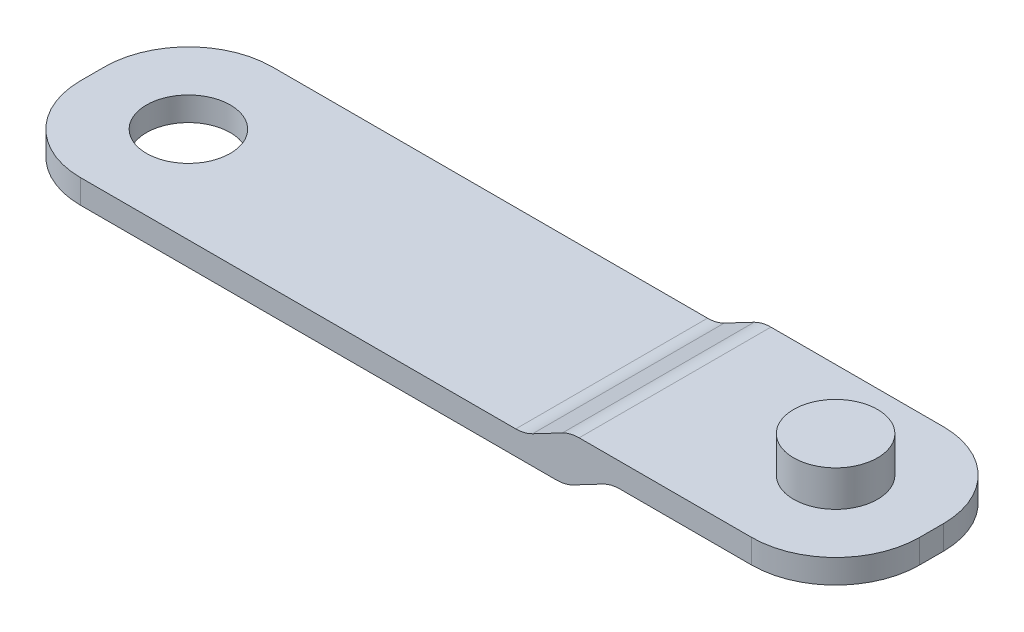
ISO-10303-21;
HEADER;
FILE_DESCRIPTION(('STEP AP214'),'2;1');
FILE_NAME('part.step','',(''),(''),'','','');
FILE_SCHEMA(('AUTOMOTIVE_DESIGN { 1 0 10303 214 1 1 1 1 }'));
ENDSEC;
DATA;
#1=APPLICATION_CONTEXT('core data for automotive mechanical design processes');
#2=APPLICATION_PROTOCOL_DEFINITION('international standard','automotive_design',2000,#1);
#3=PRODUCT_CONTEXT('',#1,'mechanical');
#4=PRODUCT('Part','Part','',(#3));
#5=PRODUCT_RELATED_PRODUCT_CATEGORY('part','',(#4));
#6=PRODUCT_DEFINITION_FORMATION('','',#4);
#7=PRODUCT_DEFINITION_CONTEXT('part definition',#1,'design');
#8=PRODUCT_DEFINITION('design','',#6,#7);
#9=PRODUCT_DEFINITION_SHAPE('','',#8);
#10=(LENGTH_UNIT() NAMED_UNIT(*) SI_UNIT(.MILLI.,.METRE.));
#11=(NAMED_UNIT(*) PLANE_ANGLE_UNIT() SI_UNIT($,.RADIAN.));
#12=(NAMED_UNIT(*) SI_UNIT($,.STERADIAN.) SOLID_ANGLE_UNIT());
#13=UNCERTAINTY_MEASURE_WITH_UNIT(LENGTH_MEASURE(1.E-05),#10,'distance_accuracy_value','');
#14=(GEOMETRIC_REPRESENTATION_CONTEXT(3) GLOBAL_UNCERTAINTY_ASSIGNED_CONTEXT((#13)) GLOBAL_UNIT_ASSIGNED_CONTEXT((#10,
#11,#12)) REPRESENTATION_CONTEXT('',''));
#15=CARTESIAN_POINT('',(0.,0.,0.));
#16=DIRECTION('',(0.,0.,1.));
#17=DIRECTION('',(1.,0.,0.));
#18=AXIS2_PLACEMENT_3D('',#15,#16,#17);
#19=CARTESIAN_POINT('',(35.4089529862073,4.,0.000403363956020933));
#20=DIRECTION('',(-0.999999999935116,0.,-1.13915809979437E-05));
#21=DIRECTION('',(-1.13915809979437E-05,0.,0.999999999935116));
#22=AXIS2_PLACEMENT_3D('',#19,#20,#21);
#23=PLANE('',#22);
#24=DIRECTION('',(0.,-1.,0.));
#25=VECTOR('',#24,1.);
#26=CARTESIAN_POINT('',(35.4089408148206,4.,1.06885792671711));
#27=LINE('',#26,#25);
#28=CARTESIAN_POINT('',(35.4089408148206,4.,1.06885792671711));
#29=VERTEX_POINT('',#28);
#30=CARTESIAN_POINT('',(35.4089408148207,2.,1.0688579267171));
#31=VERTEX_POINT('',#30);
#32=EDGE_CURVE('E207',#29,#31,#27,.T.);
#33=ORIENTED_EDGE('',*,*,#32,.T.);
#34=DIRECTION('',(-1.13915810110164E-05,0.,0.999999999935116));
#35=VECTOR('',#34,1.);
#36=CARTESIAN_POINT('',(35.4090433472251,2.,-7.93185974184842));
#37=LINE('',#36,#35);
#38=CARTESIAN_POINT('',(35.4089635979827,2.,-0.931142073153133));
#39=VERTEX_POINT('',#38);
#40=EDGE_CURVE('E184',#39,#31,#37,.T.);
#41=ORIENTED_EDGE('',*,*,#40,.F.);
#42=DIRECTION('',(0.,-1.,0.));
#43=VECTOR('',#42,1.);
#44=CARTESIAN_POINT('',(35.4089635979826,4.,-0.931142073153123));
#45=LINE('',#44,#43);
#46=CARTESIAN_POINT('',(35.4089635979826,4.,-0.931142073153123));
#47=VERTEX_POINT('',#46);
#48=EDGE_CURVE('E191',#47,#39,#45,.T.);
#49=ORIENTED_EDGE('',*,*,#48,.F.);
#50=DIRECTION('',(1.13915809979437E-05,0.,-0.999999999935116));
#51=VECTOR('',#50,1.);
#52=CARTESIAN_POINT('',(35.4089529862073,4.,0.000403363956020933));
#53=LINE('',#52,#51);
#54=EDGE_CURVE('E336',#29,#47,#53,.T.);
#55=ORIENTED_EDGE('',*,*,#54,.F.);
#56=EDGE_LOOP('',(#33,#41,#49,#55));
#57=FACE_BOUND('',#56,.T.);
#58=ADVANCED_FACE('F63',(#57),#23,.F.);
#59=CARTESIAN_POINT('',(28.4089635984368,4.,-0.931221814220212));
#60=DIRECTION('',(0.,-1.,0.));
#61=DIRECTION('',(0.,0.,-1.));
#62=AXIS2_PLACEMENT_3D('',#59,#60,#61);
#63=CYLINDRICAL_SURFACE('',#62,7.);
#64=ORIENTED_EDGE('',*,*,#48,.T.);
#65=CARTESIAN_POINT('',(28.4089635984368,2.,-0.931221814220212));
#66=DIRECTION('',(0.,1.,0.));
#67=DIRECTION('',(0.,0.,1.));
#68=AXIS2_PLACEMENT_3D('',#65,#66,#67);
#69=CIRCLE('',#68,7.);
#70=CARTESIAN_POINT('',(28.409043339504,2.,-7.93122181376603));
#71=VERTEX_POINT('',#70);
#72=EDGE_CURVE('E237',#39,#71,#69,.T.);
#73=ORIENTED_EDGE('',*,*,#72,.T.);
#74=DIRECTION('',(0.,-1.,0.));
#75=VECTOR('',#74,1.);
#76=CARTESIAN_POINT('',(28.409043339504,4.,-7.93122181376603));
#77=LINE('',#76,#75);
#78=CARTESIAN_POINT('',(28.409043339504,4.,-7.93122181376603));
#79=VERTEX_POINT('',#78);
#80=EDGE_CURVE('E225',#79,#71,#77,.T.);
#81=ORIENTED_EDGE('',*,*,#80,.F.);
#82=CARTESIAN_POINT('',(28.4089635984368,4.,-0.931221814220212));
#83=DIRECTION('',(0.,1.,0.));
#84=DIRECTION('',(0.,0.,1.));
#85=AXIS2_PLACEMENT_3D('',#82,#83,#84);
#86=CIRCLE('',#85,7.);
#87=EDGE_CURVE('E340',#47,#79,#86,.T.);
#88=ORIENTED_EDGE('',*,*,#87,.F.);
#89=EDGE_LOOP('',(#64,#73,#81,#88));
#90=FACE_BOUND('',#89,.T.);
#91=ADVANCED_FACE('F391',(#90),#63,.T.);
#92=CARTESIAN_POINT('',(9.03528424001264E-05,4.,-7.93154543665548));
#93=DIRECTION('',(-1.13915810122829E-05,0.,0.999999999935116));
#94=DIRECTION('',(0.999999999935116,0.,1.13915810122829E-05));
#95=AXIS2_PLACEMENT_3D('',#92,#93,#94);
#96=PLANE('',#95);
#97=DIRECTION('',(0.885249595787876,0.465116279069769,1.00843924871626E-05));
#98=VECTOR('',#97,1.);
#99=CARTESIAN_POINT('',(2.87114327741969,-1.46443664878954,-7.93151273082349));
#100=LINE('',#99,#98);
#101=CARTESIAN_POINT('',(10.1201679651821,2.34425121246406,-7.9314301529715));
#102=VERTEX_POINT('',#101);
#103=CARTESIAN_POINT('',(12.6163237663318,3.65574878753595,-7.93140171781047));
#104=VERTEX_POINT('',#103);
#105=EDGE_CURVE('E286',#102,#104,#100,.T.);
#106=ORIENTED_EDGE('',*,*,#105,.T.);
#107=CARTESIAN_POINT('',(14.0116726034506,1.,-7.93138582258115));
#108=DIRECTION('',(-1.13915810122829E-05,0.,0.999999999935116));
#109=DIRECTION('',(0.999999999935116,0.,1.13915810122829E-05));
#110=AXIS2_PLACEMENT_3D('',#107,#108,#109);
#111=CIRCLE('',#110,3.);
#112=CARTESIAN_POINT('',(14.0116726034506,4.,-7.93138582258115));
#113=VERTEX_POINT('',#112);
#114=EDGE_CURVE('E248',#104,#113,#111,.F.);
#115=ORIENTED_EDGE('',*,*,#114,.T.);
#116=DIRECTION('',(-0.999999999935116,0.,-1.13915810122829E-05));
#117=VECTOR('',#116,1.);
#118=CARTESIAN_POINT('',(9.03528424001264E-05,4.,-7.93154543665548));
#119=LINE('',#118,#117);
#120=EDGE_CURVE('E344',#79,#113,#119,.T.);
#121=ORIENTED_EDGE('',*,*,#120,.F.);
#122=ORIENTED_EDGE('',*,*,#80,.T.);
#123=DIRECTION('',(-0.999999999935116,0.,-1.13915810122829E-05));
#124=VECTOR('',#123,1.);
#125=CARTESIAN_POINT('',(9.03528424001264E-05,2.,-7.93154543665548));
#126=LINE('',#125,#124);
#127=CARTESIAN_POINT('',(17.4052778946254,2.,-7.93134716405155));
#128=VERTEX_POINT('',#127);
#129=EDGE_CURVE('E297',#71,#128,#126,.T.);
#130=ORIENTED_EDGE('',*,*,#129,.T.);
#131=CARTESIAN_POINT('',(17.4052778946254,-1.,-7.93134716405155));
#132=DIRECTION('',(-1.13915810122829E-05,0.,0.999999999935116));
#133=DIRECTION('',(0.999999999935116,0.,1.13915810122829E-05));
#134=AXIS2_PLACEMENT_3D('',#131,#132,#133);
#135=CIRCLE('',#134,3.);
#136=CARTESIAN_POINT('',(16.0099290575066,1.65574878753595,-7.93136305928086));
#137=VERTEX_POINT('',#136);
#138=EDGE_CURVE('E12',#128,#137,#135,.T.);
#139=ORIENTED_EDGE('',*,*,#138,.T.);
#140=DIRECTION('',(-0.885249595787877,-0.465116279069768,-1.00843924871626E-05));
#141=VECTOR('',#140,1.);
#142=CARTESIAN_POINT('',(4.42878060636781,-4.42906695322044,-7.93149498687167));
#143=LINE('',#142,#141);
#144=CARTESIAN_POINT('',(13.5137732563569,0.344251212464054,-7.9313914944419));
#145=VERTEX_POINT('',#144);
#146=EDGE_CURVE('E298',#137,#145,#143,.T.);
#147=ORIENTED_EDGE('',*,*,#146,.T.);
#148=CARTESIAN_POINT('',(12.1184244192382,3.,-7.93140738967122));
#149=DIRECTION('',(-1.13915810122829E-05,0.,0.999999999935116));
#150=DIRECTION('',(0.999999999935116,0.,1.13915810122829E-05));
#151=AXIS2_PLACEMENT_3D('',#148,#149,#150);
#152=CIRCLE('',#151,3.);
#153=CARTESIAN_POINT('',(12.1184244192382,0.,-7.93140738967122));
#154=VERTEX_POINT('',#153);
#155=EDGE_CURVE('E245',#145,#154,#152,.F.);
#156=ORIENTED_EDGE('',*,*,#155,.T.);
#157=DIRECTION('',(-0.999999999935116,0.,-1.13915810122829E-05));
#158=VECTOR('',#157,1.);
#159=CARTESIAN_POINT('',(9.03528424001264E-05,0.,-7.93154543665548));
#160=LINE('',#159,#158);
#161=CARTESIAN_POINT('',(-27.5909566568626,0.,-7.93185974230271));
#162=VERTEX_POINT('',#161);
#163=EDGE_CURVE('E356',#154,#162,#160,.T.);
#164=ORIENTED_EDGE('',*,*,#163,.T.);
#165=DIRECTION('',(0.,-1.,0.));
#166=VECTOR('',#165,1.);
#167=CARTESIAN_POINT('',(-27.5909566568626,4.,-7.93185974230271));
#168=LINE('',#167,#166);
#169=CARTESIAN_POINT('',(-27.5909566568626,2.,-7.9318597423027));
#170=VERTEX_POINT('',#169);
#171=EDGE_CURVE('E221',#170,#162,#168,.T.);
#172=ORIENTED_EDGE('',*,*,#171,.F.);
#173=DIRECTION('',(0.999999999935116,0.,1.13915810122829E-05));
#174=VECTOR('',#173,1.);
#175=CARTESIAN_POINT('',(9.03528424001264E-05,2.,-7.93154543665548));
#176=LINE('',#175,#174);
#177=CARTESIAN_POINT('',(8.72481912806332,2.,-7.93144604820082));
#178=VERTEX_POINT('',#177);
#179=EDGE_CURVE('E288',#170,#178,#176,.T.);
#180=ORIENTED_EDGE('',*,*,#179,.T.);
#181=CARTESIAN_POINT('',(8.72481912806332,5.,-7.93144604820082));
#182=DIRECTION('',(-1.13915810122829E-05,0.,0.999999999935116));
#183=DIRECTION('',(0.999999999935116,0.,1.13915810122829E-05));
#184=AXIS2_PLACEMENT_3D('',#181,#182,#183);
#185=CIRCLE('',#184,3.);
#186=EDGE_CURVE('E277',#178,#102,#185,.T.);
#187=ORIENTED_EDGE('',*,*,#186,.T.);
#188=EDGE_LOOP('',(#106,#115,#121,#122,#130,#139,#147,#156,#164,#172,#180,#187));
#189=FACE_BOUND('',#188,.T.);
#190=ADVANCED_FACE('F285',(#189),#96,.F.);
#191=CARTESIAN_POINT('',(-27.5910363979297,4.,-0.931859742756886));
#192=DIRECTION('',(0.,-1.,0.));
#193=DIRECTION('',(0.,0.,-1.));
#194=AXIS2_PLACEMENT_3D('',#191,#192,#193);
#195=CYLINDRICAL_SURFACE('',#194,7.);
#196=DIRECTION('',(0.,-1.,0.));
#197=VECTOR('',#196,1.);
#198=CARTESIAN_POINT('',(-34.5910363974755,4.,-0.931939483823968));
#199=LINE('',#198,#197);
#200=CARTESIAN_POINT('',(-34.5910363974755,2.,-0.931939483823968));
#201=VERTEX_POINT('',#200);
#202=CARTESIAN_POINT('',(-34.5910363974755,0.,-0.931939483823968));
#203=VERTEX_POINT('',#202);
#204=EDGE_CURVE('E218',#201,#203,#199,.T.);
#205=ORIENTED_EDGE('',*,*,#204,.F.);
#206=CARTESIAN_POINT('',(-27.5910363979297,2.,-0.931859742756886));
#207=DIRECTION('',(0.,-1.,0.));
#208=DIRECTION('',(0.,0.,-1.));
#209=AXIS2_PLACEMENT_3D('',#206,#207,#208);
#210=CIRCLE('',#209,7.);
#211=EDGE_CURVE('E330',#201,#170,#210,.T.);
#212=ORIENTED_EDGE('',*,*,#211,.T.);
#213=ORIENTED_EDGE('',*,*,#171,.T.);
#214=CARTESIAN_POINT('',(-27.5910363979297,0.,-0.931859742756886));
#215=DIRECTION('',(0.,1.,0.));
#216=DIRECTION('',(0.,0.,1.));
#217=AXIS2_PLACEMENT_3D('',#214,#215,#216);
#218=CIRCLE('',#217,7.);
#219=EDGE_CURVE('E359',#162,#203,#218,.T.);
#220=ORIENTED_EDGE('',*,*,#219,.T.);
#221=EDGE_LOOP('',(#205,#212,#213,#220));
#222=FACE_BOUND('',#221,.T.);
#223=ADVANCED_FACE('F448',(#222),#195,.T.);
#224=CARTESIAN_POINT('',(-34.5910470092508,4.,-0.000394046714075155));
#225=DIRECTION('',(0.999999999935116,0.,1.13915810048827E-05));
#226=DIRECTION('',(1.13915810048827E-05,0.,-0.999999999935116));
#227=AXIS2_PLACEMENT_3D('',#224,#225,#226);
#228=PLANE('',#227);
#229=DIRECTION('',(0.,-1.,0.));
#230=VECTOR('',#229,1.);
#231=CARTESIAN_POINT('',(-34.5910591806375,4.,1.06806051604623));
#232=LINE('',#231,#230);
#233=CARTESIAN_POINT('',(-34.5910591806375,2.,1.06806051604627));
#234=VERTEX_POINT('',#233);
#235=CARTESIAN_POINT('',(-34.5910591806375,0.,1.06806051604623));
#236=VERTEX_POINT('',#235);
#237=EDGE_CURVE('E211',#234,#236,#232,.T.);
#238=ORIENTED_EDGE('',*,*,#237,.F.);
#239=DIRECTION('',(-1.13915810110164E-05,0.,0.999999999935116));
#240=VECTOR('',#239,1.);
#241=CARTESIAN_POINT('',(-34.590956648233,2.,-7.9326571525192));
#242=LINE('',#241,#240);
#243=EDGE_CURVE('E312',#201,#234,#242,.T.);
#244=ORIENTED_EDGE('',*,*,#243,.F.);
#245=ORIENTED_EDGE('',*,*,#204,.T.);
#246=DIRECTION('',(-1.13915810048827E-05,0.,0.999999999935116));
#247=VECTOR('',#246,1.);
#248=CARTESIAN_POINT('',(-34.5910470092508,0.,-0.000394046714075155));
#249=LINE('',#248,#247);
#250=EDGE_CURVE('E363',#203,#236,#249,.T.);
#251=ORIENTED_EDGE('',*,*,#250,.T.);
#252=EDGE_LOOP('',(#238,#244,#245,#251));
#253=FACE_BOUND('',#252,.T.);
#254=ADVANCED_FACE('F444',(#253),#228,.F.);
#255=CARTESIAN_POINT('',(-27.5910591810917,4.,1.06814025711334));
#256=DIRECTION('',(0.,-1.,0.));
#257=DIRECTION('',(0.,0.,-1.));
#258=AXIS2_PLACEMENT_3D('',#255,#256,#257);
#259=CYLINDRICAL_SURFACE('',#258,7.00000000000001);
#260=DIRECTION('',(0.,-1.,0.));
#261=VECTOR('',#260,1.);
#262=CARTESIAN_POINT('',(-27.5911389221588,4.,8.06814025665917));
#263=LINE('',#262,#261);
#264=CARTESIAN_POINT('',(-27.5911389221588,2.,8.06814025665916));
#265=VERTEX_POINT('',#264);
#266=CARTESIAN_POINT('',(-27.5911389221588,0.,8.06814025665917));
#267=VERTEX_POINT('',#266);
#268=EDGE_CURVE('E206',#265,#267,#263,.T.);
#269=ORIENTED_EDGE('',*,*,#268,.F.);
#270=CARTESIAN_POINT('',(-27.5910591810917,2.,1.06814025711334));
#271=DIRECTION('',(0.,-1.,0.));
#272=DIRECTION('',(0.,0.,-1.));
#273=AXIS2_PLACEMENT_3D('',#270,#271,#272);
#274=CIRCLE('',#273,7.00000000000001);
#275=EDGE_CURVE('E236',#265,#234,#274,.T.);
#276=ORIENTED_EDGE('',*,*,#275,.T.);
#277=ORIENTED_EDGE('',*,*,#237,.T.);
#278=CARTESIAN_POINT('',(-27.5910591810917,0.,1.06814025711334));
#279=DIRECTION('',(0.,1.,0.));
#280=DIRECTION('',(0.,0.,1.));
#281=AXIS2_PLACEMENT_3D('',#278,#279,#280);
#282=CIRCLE('',#281,7.00000000000001);
#283=EDGE_CURVE('E367',#236,#267,#282,.T.);
#284=ORIENTED_EDGE('',*,*,#283,.T.);
#285=EDGE_LOOP('',(#269,#276,#277,#284));
#286=FACE_BOUND('',#285,.T.);
#287=ADVANCED_FACE('F425',(#286),#259,.T.);
#288=CARTESIAN_POINT('',(-9.19124537861815E-05,4.,8.06845456230638));
#289=DIRECTION('',(1.13915810110164E-05,0.,-0.999999999935116));
#290=DIRECTION('',(-0.999999999935116,0.,-1.13915810110164E-05));
#291=AXIS2_PLACEMENT_3D('',#288,#289,#290);
#292=PLANE('',#291);
#293=DIRECTION('',(0.999999999935116,0.,1.13915810110164E-05));
#294=VECTOR('',#293,1.);
#295=CARTESIAN_POINT('',(-9.19124537861815E-05,4.,8.06845456230638));
#296=LINE('',#295,#294);
#297=CARTESIAN_POINT('',(14.0114903381544,4.,8.06861417638069));
#298=VERTEX_POINT('',#297);
#299=CARTESIAN_POINT('',(28.4088610742077,4.,8.06877818519584));
#300=VERTEX_POINT('',#299);
#301=EDGE_CURVE('E348',#298,#300,#296,.T.);
#302=ORIENTED_EDGE('',*,*,#301,.F.);
#303=CARTESIAN_POINT('',(14.0114903381544,1.,8.06861417638069));
#304=DIRECTION('',(1.13915810110164E-05,0.,-0.999999999935116));
#305=DIRECTION('',(-0.999999999935116,0.,-1.13915810110164E-05));
#306=AXIS2_PLACEMENT_3D('',#303,#304,#305);
#307=CIRCLE('',#306,3.);
#308=CARTESIAN_POINT('',(12.6161415010356,3.65574878753594,8.06859828115137));
#309=VERTEX_POINT('',#308);
#310=EDGE_CURVE('E256',#298,#309,#307,.F.);
#311=ORIENTED_EDGE('',*,*,#310,.T.);
#312=DIRECTION('',(0.885249595787876,0.465116279069768,1.00843924860584E-05));
#313=VECTOR('',#312,1.);
#314=CARTESIAN_POINT('',(1.22398501996001,-2.32976926101237,8.06846850647791));
#315=LINE('',#314,#313);
#316=CARTESIAN_POINT('',(10.1199856998859,2.34425121246405,8.06856984599034));
#317=VERTEX_POINT('',#316);
#318=EDGE_CURVE('E308',#317,#309,#315,.T.);
#319=ORIENTED_EDGE('',*,*,#318,.F.);
#320=CARTESIAN_POINT('',(8.72463686276714,5.,8.06855395076103));
#321=DIRECTION('',(1.13915810110164E-05,0.,-0.999999999935116));
#322=DIRECTION('',(-0.999999999935116,0.,-1.13915810110164E-05));
#323=AXIS2_PLACEMENT_3D('',#320,#321,#322);
#324=CIRCLE('',#323,3.);
#325=CARTESIAN_POINT('',(8.72463686276715,2.,8.06855395076102));
#326=VERTEX_POINT('',#325);
#327=EDGE_CURVE('E87',#317,#326,#324,.T.);
#328=ORIENTED_EDGE('',*,*,#327,.T.);
#329=DIRECTION('',(0.999999999935116,0.,1.13915810110297E-05));
#330=VECTOR('',#329,1.);
#331=CARTESIAN_POINT('',(-9.1912453786289E-05,2.,8.06845456230637));
#332=LINE('',#331,#330);
#333=EDGE_CURVE('E304',#265,#326,#332,.T.);
#334=ORIENTED_EDGE('',*,*,#333,.F.);
#335=ORIENTED_EDGE('',*,*,#268,.T.);
#336=DIRECTION('',(0.999999999935116,0.,1.13915810110164E-05));
#337=VECTOR('',#336,1.);
#338=CARTESIAN_POINT('',(-9.19124537861815E-05,0.,8.06845456230638));
#339=LINE('',#338,#337);
#340=CARTESIAN_POINT('',(12.118242153942,0.,8.06859260929062));
#341=VERTEX_POINT('',#340);
#342=EDGE_CURVE('E341',#267,#341,#339,.T.);
#343=ORIENTED_EDGE('',*,*,#342,.T.);
#344=CARTESIAN_POINT('',(12.118242153942,3.,8.06859260929062));
#345=DIRECTION('',(1.13915810110164E-05,0.,-0.999999999935116));
#346=DIRECTION('',(-0.999999999935116,0.,-1.13915810110164E-05));
#347=AXIS2_PLACEMENT_3D('',#344,#345,#346);
#348=CIRCLE('',#347,3.);
#349=CARTESIAN_POINT('',(13.5135909910607,0.344251212464052,8.06860850451994));
#350=VERTEX_POINT('',#349);
#351=EDGE_CURVE('E79',#341,#350,#348,.F.);
#352=ORIENTED_EDGE('',*,*,#351,.T.);
#353=DIRECTION('',(-0.885249595787877,-0.465116279069768,-1.00843924860584E-05));
#354=VECTOR('',#353,1.);
#355=CARTESIAN_POINT('',(2.78162234890813,-5.29439956544326,8.06848625042973));
#356=LINE('',#355,#354);
#357=CARTESIAN_POINT('',(16.0097467922105,1.65574878753594,8.06863693968096));
#358=VERTEX_POINT('',#357);
#359=EDGE_CURVE('E200',#358,#350,#356,.T.);
#360=ORIENTED_EDGE('',*,*,#359,.F.);
#361=CARTESIAN_POINT('',(17.4050956293292,-1.,8.06865283491028));
#362=DIRECTION('',(1.13915810110164E-05,0.,-0.999999999935116));
#363=DIRECTION('',(-0.999999999935116,0.,-1.13915810110164E-05));
#364=AXIS2_PLACEMENT_3D('',#361,#362,#363);
#365=CIRCLE('',#364,3.);
#366=CARTESIAN_POINT('',(17.4050956293292,2.,8.06865283491028));
#367=VERTEX_POINT('',#366);
#368=EDGE_CURVE('E72',#358,#367,#365,.T.);
#369=ORIENTED_EDGE('',*,*,#368,.T.);
#370=DIRECTION('',(-0.999999999935116,0.,-1.13915810110297E-05));
#371=VECTOR('',#370,1.);
#372=CARTESIAN_POINT('',(-9.1912453786289E-05,2.,8.06845456230637));
#373=LINE('',#372,#371);
#374=CARTESIAN_POINT('',(28.4088610742078,2.,8.06877818519578));
#375=VERTEX_POINT('',#374);
#376=EDGE_CURVE('E181',#375,#367,#373,.T.);
#377=ORIENTED_EDGE('',*,*,#376,.F.);
#378=DIRECTION('',(0.,-1.,0.));
#379=VECTOR('',#378,1.);
#380=CARTESIAN_POINT('',(28.4088610742077,4.,8.06877818519584));
#381=LINE('',#380,#379);
#382=EDGE_CURVE('E196',#300,#375,#381,.T.);
#383=ORIENTED_EDGE('',*,*,#382,.F.);
#384=EDGE_LOOP('',(#302,#311,#319,#328,#334,#335,#343,#352,#360,#369,#377,#383));
#385=FACE_BOUND('',#384,.T.);
#386=ADVANCED_FACE('F195',(#385),#292,.F.);
#387=CARTESIAN_POINT('',(-26.5910477895756,4.,0.0681516487592484));
#388=DIRECTION('',(0.,-1.,0.));
#389=DIRECTION('',(0.,0.,-1.));
#390=AXIS2_PLACEMENT_3D('',#387,#388,#389);
#391=CYLINDRICAL_SURFACE('',#390,3.5);
#392=CARTESIAN_POINT('',(-26.5910477895756,2.,0.0681516487592484));
#393=DIRECTION('',(0.,-1.,0.));
#394=DIRECTION('',(0.,0.,-1.));
#395=AXIS2_PLACEMENT_3D('',#392,#393,#394);
#396=CIRCLE('',#395,3.5);
#397=CARTESIAN_POINT('',(-26.5910477895756,2.,-3.43184835124075));
#398=VERTEX_POINT('',#397);
#399=EDGE_CURVE('E232',#398,#398,#396,.T.);
#400=ORIENTED_EDGE('',*,*,#399,.F.);
#401=EDGE_LOOP('',(#400));
#402=FACE_BOUND('',#401,.T.);
#403=CARTESIAN_POINT('',(-26.5910477895756,0.,0.0681516487592484));
#404=DIRECTION('',(0.,1.,0.));
#405=DIRECTION('',(0.,0.,1.));
#406=AXIS2_PLACEMENT_3D('',#403,#404,#405);
#407=CIRCLE('',#406,3.5);
#408=CARTESIAN_POINT('',(-26.5910477895756,0.,3.56815164875925));
#409=VERTEX_POINT('',#408);
#410=EDGE_CURVE('E335',#409,#409,#407,.T.);
#411=ORIENTED_EDGE('',*,*,#410,.F.);
#412=EDGE_LOOP('',(#411));
#413=FACE_BOUND('',#412,.T.);
#414=ADVANCED_FACE('F417',(#402,#413),#391,.F.);
#415=CARTESIAN_POINT('',(28.4089408152748,4.,1.06877818565002));
#416=DIRECTION('',(0.,-1.,0.));
#417=DIRECTION('',(0.,0.,-1.));
#418=AXIS2_PLACEMENT_3D('',#415,#416,#417);
#419=CYLINDRICAL_SURFACE('',#418,7.);
#420=ORIENTED_EDGE('',*,*,#382,.T.);
#421=CARTESIAN_POINT('',(28.4089408152748,2.,1.06877818565002));
#422=DIRECTION('',(0.,1.,0.));
#423=DIRECTION('',(0.,0.,1.));
#424=AXIS2_PLACEMENT_3D('',#421,#422,#423);
#425=CIRCLE('',#424,7.);
#426=EDGE_CURVE('E178',#375,#31,#425,.T.);
#427=ORIENTED_EDGE('',*,*,#426,.T.);
#428=ORIENTED_EDGE('',*,*,#32,.F.);
#429=CARTESIAN_POINT('',(28.4089408152748,4.,1.06877818565002));
#430=DIRECTION('',(0.,1.,0.));
#431=DIRECTION('',(0.,0.,1.));
#432=AXIS2_PLACEMENT_3D('',#429,#430,#431);
#433=CIRCLE('',#432,7.);
#434=EDGE_CURVE('E204',#300,#29,#433,.T.);
#435=ORIENTED_EDGE('',*,*,#434,.F.);
#436=EDGE_LOOP('',(#420,#427,#428,#435));
#437=FACE_BOUND('',#436,.T.);
#438=ADVANCED_FACE('F203',(#437),#419,.T.);
#439=CARTESIAN_POINT('',(0.,4.,0.));
#440=DIRECTION('',(0.,1.,0.));
#441=DIRECTION('',(0.,0.,1.));
#442=AXIS2_PLACEMENT_3D('',#439,#440,#441);
#443=PLANE('',#442);
#444=CARTESIAN_POINT('',(27.4089522069207,4.,0.068766794133885));
#445=DIRECTION('',(0.,1.,0.));
#446=DIRECTION('',(0.,0.,1.));
#447=AXIS2_PLACEMENT_3D('',#444,#445,#446);
#448=CIRCLE('',#447,3.49999999999999);
#449=CARTESIAN_POINT('',(27.4089522069207,4.,3.56876679413387));
#450=VERTEX_POINT('',#449);
#451=EDGE_CURVE('E566',#450,#450,#448,.T.);
#452=ORIENTED_EDGE('',*,*,#451,.F.);
#453=EDGE_LOOP('',(#452));
#454=FACE_BOUND('',#453,.T.);
#455=ORIENTED_EDGE('',*,*,#120,.T.);
#456=DIRECTION('',(1.13915810110164E-05,0.,-0.999999999935116));
#457=VECTOR('',#456,1.);
#458=CARTESIAN_POINT('',(14.0114903381544,4.,8.06861417638069));
#459=LINE('',#458,#457);
#460=EDGE_CURVE('E251',#113,#298,#459,.F.);
#461=ORIENTED_EDGE('',*,*,#460,.T.);
#462=ORIENTED_EDGE('',*,*,#301,.T.);
#463=ORIENTED_EDGE('',*,*,#434,.T.);
#464=ORIENTED_EDGE('',*,*,#54,.T.);
#465=ORIENTED_EDGE('',*,*,#87,.T.);
#466=EDGE_LOOP('',(#455,#461,#462,#463,#464,#465));
#467=FACE_BOUND('',#466,.T.);
#468=ADVANCED_FACE('F396',(#454,#467),#443,.T.);
#469=CARTESIAN_POINT('',(0.,0.,0.));
#470=DIRECTION('',(0.,1.,0.));
#471=DIRECTION('',(0.,0.,1.));
#472=AXIS2_PLACEMENT_3D('',#469,#470,#471);
#473=PLANE('',#472);
#474=ORIENTED_EDGE('',*,*,#410,.T.);
#475=EDGE_LOOP('',(#474));
#476=FACE_BOUND('',#475,.T.);
#477=ORIENTED_EDGE('',*,*,#163,.F.);
#478=DIRECTION('',(-1.13915810110164E-05,0.,0.999999999935116));
#479=VECTOR('',#478,1.);
#480=CARTESIAN_POINT('',(12.1183340663958,0.,0.000138046984244864));
#481=LINE('',#480,#479);
#482=EDGE_CURVE('E262',#154,#341,#481,.T.);
#483=ORIENTED_EDGE('',*,*,#482,.T.);
#484=ORIENTED_EDGE('',*,*,#342,.F.);
#485=ORIENTED_EDGE('',*,*,#283,.F.);
#486=ORIENTED_EDGE('',*,*,#250,.F.);
#487=ORIENTED_EDGE('',*,*,#219,.F.);
#488=EDGE_LOOP('',(#477,#483,#484,#485,#486,#487));
#489=FACE_BOUND('',#488,.T.);
#490=ADVANCED_FACE('F377',(#476,#489),#473,.F.);
#491=CARTESIAN_POINT('',(9.03610177762285E-05,2.,-7.93226310580491));
#492=DIRECTION('',(0.,1.,0.));
#493=DIRECTION('',(0.,0.,1.));
#494=AXIS2_PLACEMENT_3D('',#491,#492,#493);
#495=PLANE('',#494);
#496=ORIENTED_EDGE('',*,*,#376,.T.);
#497=DIRECTION('',(-1.13915810110164E-05,0.,0.999999999935116));
#498=VECTOR('',#497,1.);
#499=CARTESIAN_POINT('',(17.4052778946254,2.,-7.93134716405155));
#500=LINE('',#499,#498);
#501=EDGE_CURVE('E272',#367,#128,#500,.F.);
#502=ORIENTED_EDGE('',*,*,#501,.T.);
#503=ORIENTED_EDGE('',*,*,#129,.F.);
#504=ORIENTED_EDGE('',*,*,#72,.F.);
#505=ORIENTED_EDGE('',*,*,#40,.T.);
#506=ORIENTED_EDGE('',*,*,#426,.F.);
#507=EDGE_LOOP('',(#496,#502,#503,#504,#505,#506));
#508=FACE_BOUND('',#507,.T.);
#509=ADVANCED_FACE('F180',(#508),#495,.F.);
#510=CARTESIAN_POINT('',(2.78180462237969,-5.29439956544326,-7.93223141768155));
#511=DIRECTION('',(-0.465116279039589,0.885249595845315,-5.29840977256576E-06));
#512=DIRECTION('',(-0.885249595857741,-0.465116279046118,0.));
#513=AXIS2_PLACEMENT_3D('',#510,#511,#512);
#514=PLANE('',#513);
#515=ORIENTED_EDGE('',*,*,#359,.T.);
#516=DIRECTION('',(-1.13915810110164E-05,0.,0.999999999935116));
#517=VECTOR('',#516,1.);
#518=CARTESIAN_POINT('',(13.5137732645323,0.344251212464053,-7.93210916359135));
#519=LINE('',#518,#517);
#520=EDGE_CURVE('E269',#350,#145,#519,.F.);
#521=ORIENTED_EDGE('',*,*,#520,.T.);
#522=ORIENTED_EDGE('',*,*,#146,.F.);
#523=DIRECTION('',(-1.13915810110164E-05,0.,0.999999999935116));
#524=VECTOR('',#523,1.);
#525=CARTESIAN_POINT('',(16.0097467922105,1.65574878753595,8.06863693968096));
#526=LINE('',#525,#524);
#527=EDGE_CURVE('E265',#137,#358,#526,.T.);
#528=ORIENTED_EDGE('',*,*,#527,.T.);
#529=EDGE_LOOP('',(#515,#521,#522,#528));
#530=FACE_BOUND('',#529,.T.);
#531=ADVANCED_FACE('F386',(#530),#514,.F.);
#532=CARTESIAN_POINT('',(9.03610177762285E-05,2.,-7.93226310580491));
#533=DIRECTION('',(0.,-1.,0.));
#534=DIRECTION('',(0.,0.,-1.));
#535=AXIS2_PLACEMENT_3D('',#532,#533,#534);
#536=PLANE('',#535);
#537=ORIENTED_EDGE('',*,*,#399,.T.);
#538=EDGE_LOOP('',(#537));
#539=FACE_BOUND('',#538,.T.);
#540=ORIENTED_EDGE('',*,*,#333,.T.);
#541=DIRECTION('',(-1.13915810110164E-05,0.,0.999999999935116));
#542=VECTOR('',#541,1.);
#543=CARTESIAN_POINT('',(8.72481912806332,2.,-7.93144604820082));
#544=LINE('',#543,#542);
#545=EDGE_CURVE('E259',#326,#178,#544,.F.);
#546=ORIENTED_EDGE('',*,*,#545,.T.);
#547=ORIENTED_EDGE('',*,*,#179,.F.);
#548=ORIENTED_EDGE('',*,*,#211,.F.);
#549=ORIENTED_EDGE('',*,*,#243,.T.);
#550=ORIENTED_EDGE('',*,*,#275,.F.);
#551=EDGE_LOOP('',(#540,#546,#547,#548,#549,#550));
#552=FACE_BOUND('',#551,.T.);
#553=ADVANCED_FACE('F302',(#539,#552),#536,.F.);
#554=CARTESIAN_POINT('',(1.22416729343158,-2.32976926101237,-7.93224916163337));
#555=DIRECTION('',(0.46511627903959,-0.885249595845315,5.29840977256578E-06));
#556=DIRECTION('',(0.885249595857741,0.465116279046119,0.));
#557=AXIS2_PLACEMENT_3D('',#554,#555,#556);
#558=PLANE('',#557);
#559=ORIENTED_EDGE('',*,*,#318,.T.);
#560=DIRECTION('',(1.13915810110164E-05,0.,-0.999999999935116));
#561=VECTOR('',#560,1.);
#562=CARTESIAN_POINT('',(12.6163237663318,3.65574878753595,-7.93140171781047));
#563=LINE('',#562,#561);
#564=EDGE_CURVE('E241',#309,#104,#563,.T.);
#565=ORIENTED_EDGE('',*,*,#564,.T.);
#566=ORIENTED_EDGE('',*,*,#105,.F.);
#567=DIRECTION('',(-1.13915810110164E-05,0.,0.999999999935116));
#568=VECTOR('',#567,1.);
#569=CARTESIAN_POINT('',(10.1199856998859,2.34425121246405,8.06856984599035));
#570=LINE('',#569,#568);
#571=EDGE_CURVE('E190',#102,#317,#570,.T.);
#572=ORIENTED_EDGE('',*,*,#571,.T.);
#573=EDGE_LOOP('',(#559,#565,#566,#572));
#574=FACE_BOUND('',#573,.T.);
#575=ADVANCED_FACE('F294',(#574),#558,.F.);
#576=CARTESIAN_POINT('',(14.011672611626,1.,-7.9321034917306));
#577=DIRECTION('',(-1.13915810110164E-05,0.,0.999999999935116));
#578=DIRECTION('',(0.999999999935116,0.,1.13915810110164E-05));
#579=AXIS2_PLACEMENT_3D('',#576,#577,#578);
#580=CYLINDRICAL_SURFACE('',#579,3.);
#581=ORIENTED_EDGE('',*,*,#310,.F.);
#582=ORIENTED_EDGE('',*,*,#460,.F.);
#583=ORIENTED_EDGE('',*,*,#114,.F.);
#584=ORIENTED_EDGE('',*,*,#564,.F.);
#585=EDGE_LOOP('',(#581,#582,#583,#584));
#586=FACE_BOUND('',#585,.T.);
#587=ADVANCED_FACE('F400',(#586),#580,.T.);
#588=CARTESIAN_POINT('',(8.72481913623871,5.,-7.93216371735026));
#589=DIRECTION('',(1.13915810110164E-05,0.,-0.999999999935116));
#590=DIRECTION('',(-0.999999999935116,0.,-1.13915810110164E-05));
#591=AXIS2_PLACEMENT_3D('',#588,#589,#590);
#592=CYLINDRICAL_SURFACE('',#591,3.);
#593=ORIENTED_EDGE('',*,*,#186,.F.);
#594=ORIENTED_EDGE('',*,*,#545,.F.);
#595=ORIENTED_EDGE('',*,*,#327,.F.);
#596=ORIENTED_EDGE('',*,*,#571,.F.);
#597=EDGE_LOOP('',(#593,#594,#595,#596));
#598=FACE_BOUND('',#597,.T.);
#599=ADVANCED_FACE('F300',(#598),#592,.F.);
#600=CARTESIAN_POINT('',(12.1183340663958,3.,0.000138046984244864));
#601=DIRECTION('',(-1.13915810110164E-05,0.,0.999999999935116));
#602=DIRECTION('',(0.999999999935116,0.,1.13915810110164E-05));
#603=AXIS2_PLACEMENT_3D('',#600,#601,#602);
#604=CYLINDRICAL_SURFACE('',#603,3.);
#605=ORIENTED_EDGE('',*,*,#155,.F.);
#606=ORIENTED_EDGE('',*,*,#520,.F.);
#607=ORIENTED_EDGE('',*,*,#351,.F.);
#608=ORIENTED_EDGE('',*,*,#482,.F.);
#609=EDGE_LOOP('',(#605,#606,#607,#608));
#610=FACE_BOUND('',#609,.T.);
#611=ADVANCED_FACE('F381',(#610),#604,.T.);
#612=CARTESIAN_POINT('',(17.4052779028008,-1.,-7.932064833201));
#613=DIRECTION('',(1.13915810110164E-05,0.,-0.999999999935116));
#614=DIRECTION('',(-0.999999999935116,0.,-1.13915810110164E-05));
#615=AXIS2_PLACEMENT_3D('',#612,#613,#614);
#616=CYLINDRICAL_SURFACE('',#615,3.);
#617=ORIENTED_EDGE('',*,*,#138,.F.);
#618=ORIENTED_EDGE('',*,*,#501,.F.);
#619=ORIENTED_EDGE('',*,*,#368,.F.);
#620=ORIENTED_EDGE('',*,*,#527,.F.);
#621=EDGE_LOOP('',(#617,#618,#619,#620));
#622=FACE_BOUND('',#621,.T.);
#623=ADVANCED_FACE('F65',(#622),#616,.F.);
#624=CARTESIAN_POINT('',(27.4089522069207,7.,0.068766794133885));
#625=DIRECTION('',(0.,-1.,0.));
#626=DIRECTION('',(0.,0.,-1.));
#627=AXIS2_PLACEMENT_3D('',#624,#625,#626);
#628=CYLINDRICAL_SURFACE('',#627,3.49999999999999);
#629=CARTESIAN_POINT('',(27.4089522069207,7.,0.068766794133885));
#630=DIRECTION('',(0.,1.,0.));
#631=DIRECTION('',(0.,0.,1.));
#632=AXIS2_PLACEMENT_3D('',#629,#630,#631);
#633=CIRCLE('',#632,3.49999999999999);
#634=CARTESIAN_POINT('',(27.4089522069207,7.,3.56876679413387));
#635=VERTEX_POINT('',#634);
#636=EDGE_CURVE('E201',#635,#635,#633,.T.);
#637=ORIENTED_EDGE('',*,*,#636,.F.);
#638=EDGE_LOOP('',(#637));
#639=FACE_BOUND('',#638,.T.);
#640=ORIENTED_EDGE('',*,*,#451,.T.);
#641=EDGE_LOOP('',(#640));
#642=FACE_BOUND('',#641,.T.);
#643=ADVANCED_FACE('F535',(#639,#642),#628,.T.);
#644=CARTESIAN_POINT('',(27.4089522069207,7.,0.068766794133885));
#645=DIRECTION('',(0.,1.,0.));
#646=DIRECTION('',(0.,0.,1.));
#647=AXIS2_PLACEMENT_3D('',#644,#645,#646);
#648=PLANE('',#647);
#649=ORIENTED_EDGE('',*,*,#636,.T.);
#650=EDGE_LOOP('',(#649));
#651=FACE_BOUND('',#650,.T.);
#652=ADVANCED_FACE('F549',(#651),#648,.T.);
#653=CLOSED_SHELL('',(#58,#91,#190,#223,#254,#287,#386,#414,#438,#468,#490,#509,#531,#553,#575,
#587,#599,#611,#623,#643,#652));
#654=MANIFOLD_SOLID_BREP('B2',#653);
#655=ADVANCED_BREP_SHAPE_REPRESENTATION('',(#18,#654),#14);
#656=SHAPE_DEFINITION_REPRESENTATION(#9,#655);
ENDSEC;
END-ISO-10303-21;
